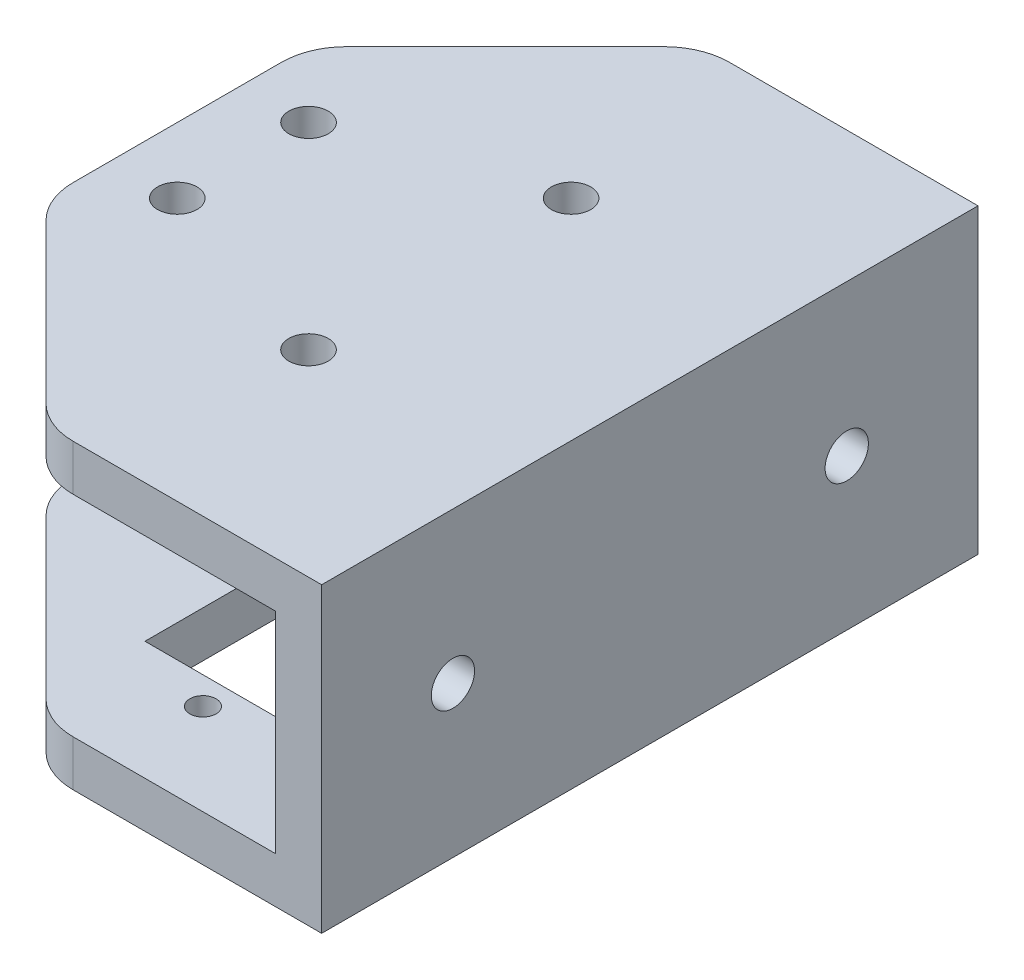
ISO-10303-21;
HEADER;
FILE_DESCRIPTION(('STEP AP214'),'2;1');
FILE_NAME('part.step','',(''),(''),'','','');
FILE_SCHEMA(('AUTOMOTIVE_DESIGN { 1 0 10303 214 1 1 1 1 }'));
ENDSEC;
DATA;
#1=APPLICATION_CONTEXT('core data for automotive mechanical design processes');
#2=APPLICATION_PROTOCOL_DEFINITION('international standard','automotive_design',2000,#1);
#3=PRODUCT_CONTEXT('',#1,'mechanical');
#4=PRODUCT('Part','Part','',(#3));
#5=PRODUCT_RELATED_PRODUCT_CATEGORY('part','',(#4));
#6=PRODUCT_DEFINITION_FORMATION('','',#4);
#7=PRODUCT_DEFINITION_CONTEXT('part definition',#1,'design');
#8=PRODUCT_DEFINITION('design','',#6,#7);
#9=PRODUCT_DEFINITION_SHAPE('','',#8);
#10=(LENGTH_UNIT() NAMED_UNIT(*) SI_UNIT(.MILLI.,.METRE.));
#11=(NAMED_UNIT(*) PLANE_ANGLE_UNIT() SI_UNIT($,.RADIAN.));
#12=(NAMED_UNIT(*) SI_UNIT($,.STERADIAN.) SOLID_ANGLE_UNIT());
#13=UNCERTAINTY_MEASURE_WITH_UNIT(LENGTH_MEASURE(1.E-05),#10,'distance_accuracy_value','');
#14=(GEOMETRIC_REPRESENTATION_CONTEXT(3) GLOBAL_UNCERTAINTY_ASSIGNED_CONTEXT((#13)) GLOBAL_UNIT_ASSIGNED_CONTEXT((#10,
#11,#12)) REPRESENTATION_CONTEXT('',''));
#15=CARTESIAN_POINT('',(0.,0.,0.));
#16=DIRECTION('',(0.,0.,1.));
#17=DIRECTION('',(1.,0.,0.));
#18=AXIS2_PLACEMENT_3D('',#15,#16,#17);
#19=CARTESIAN_POINT('',(-45.,8.,50.));
#20=DIRECTION('',(0.,1.,0.));
#21=DIRECTION('',(0.,0.,1.));
#22=AXIS2_PLACEMENT_3D('',#19,#20,#21);
#23=PLANE('',#22);
#24=CARTESIAN_POINT('',(-16.,8.,15.));
#25=DIRECTION('',(0.,1.,0.));
#26=DIRECTION('',(0.,0.,1.));
#27=AXIS2_PLACEMENT_3D('',#24,#25,#26);
#28=CIRCLE('',#27,1.5);
#29=CARTESIAN_POINT('',(-16.,8.,16.5));
#30=VERTEX_POINT('',#29);
#31=EDGE_CURVE('E300',#30,#30,#28,.T.);
#32=ORIENTED_EDGE('',*,*,#31,.T.);
#33=EDGE_LOOP('',(#32));
#34=FACE_BOUND('',#33,.T.);
#35=CARTESIAN_POINT('',(-31.,8.,30.));
#36=DIRECTION('',(0.,1.,0.));
#37=DIRECTION('',(0.,0.,1.));
#38=AXIS2_PLACEMENT_3D('',#35,#36,#37);
#39=CIRCLE('',#38,1.5);
#40=CARTESIAN_POINT('',(-31.,8.,31.5));
#41=VERTEX_POINT('',#40);
#42=EDGE_CURVE('E303',#41,#41,#39,.T.);
#43=ORIENTED_EDGE('',*,*,#42,.T.);
#44=EDGE_LOOP('',(#43));
#45=FACE_BOUND('',#44,.T.);
#46=CARTESIAN_POINT('',(-31.,8.,20.));
#47=DIRECTION('',(0.,1.,0.));
#48=DIRECTION('',(0.,0.,1.));
#49=AXIS2_PLACEMENT_3D('',#46,#47,#48);
#50=CIRCLE('',#49,1.5);
#51=CARTESIAN_POINT('',(-31.,8.,21.5));
#52=VERTEX_POINT('',#51);
#53=EDGE_CURVE('E295',#52,#52,#50,.T.);
#54=ORIENTED_EDGE('',*,*,#53,.T.);
#55=EDGE_LOOP('',(#54));
#56=FACE_BOUND('',#55,.T.);
#57=CARTESIAN_POINT('',(-16.,8.,35.));
#58=DIRECTION('',(0.,1.,0.));
#59=DIRECTION('',(0.,0.,1.));
#60=AXIS2_PLACEMENT_3D('',#57,#58,#59);
#61=CIRCLE('',#60,1.5);
#62=CARTESIAN_POINT('',(-16.,8.,36.5));
#63=VERTEX_POINT('',#62);
#64=EDGE_CURVE('E296',#63,#63,#61,.T.);
#65=ORIENTED_EDGE('',*,*,#64,.T.);
#66=EDGE_LOOP('',(#65));
#67=FACE_BOUND('',#66,.T.);
#68=DIRECTION('',(0.707106781186548,0.,0.707106781186548));
#69=VECTOR('',#68,1.);
#70=CARTESIAN_POINT('',(-33.,8.,38.));
#71=LINE('',#70,#69);
#72=CARTESIAN_POINT('',(-34.5355339059327,8.,36.4644660940672));
#73=VERTEX_POINT('',#72);
#74=CARTESIAN_POINT('',(-22.4644660940672,8.,48.5355339059327));
#75=VERTEX_POINT('',#74);
#76=EDGE_CURVE('E286',#73,#75,#71,.T.);
#77=ORIENTED_EDGE('',*,*,#76,.F.);
#78=CARTESIAN_POINT('',(-31.,8.,32.9289321881345));
#79=DIRECTION('',(0.,1.,0.));
#80=DIRECTION('',(0.,0.,1.));
#81=AXIS2_PLACEMENT_3D('',#78,#79,#80);
#82=CIRCLE('',#81,5.);
#83=CARTESIAN_POINT('',(-36.,8.,32.9289321881345));
#84=VERTEX_POINT('',#83);
#85=EDGE_CURVE('E404',#73,#84,#82,.F.);
#86=ORIENTED_EDGE('',*,*,#85,.T.);
#87=DIRECTION('',(0.,0.,1.));
#88=VECTOR('',#87,1.);
#89=CARTESIAN_POINT('',(-36.,8.,50.));
#90=LINE('',#89,#88);
#91=CARTESIAN_POINT('',(-36.,8.,17.0710678118655));
#92=VERTEX_POINT('',#91);
#93=EDGE_CURVE('E292',#92,#84,#90,.T.);
#94=ORIENTED_EDGE('',*,*,#93,.F.);
#95=CARTESIAN_POINT('',(-31.,8.,17.0710678118655));
#96=DIRECTION('',(0.,1.,0.));
#97=DIRECTION('',(0.,0.,1.));
#98=AXIS2_PLACEMENT_3D('',#95,#96,#97);
#99=CIRCLE('',#98,5.);
#100=CARTESIAN_POINT('',(-34.5355339059327,8.,13.5355339059327));
#101=VERTEX_POINT('',#100);
#102=EDGE_CURVE('E402',#92,#101,#99,.F.);
#103=ORIENTED_EDGE('',*,*,#102,.T.);
#104=DIRECTION('',(-0.707106781186548,0.,0.707106781186548));
#105=VECTOR('',#104,1.);
#106=CARTESIAN_POINT('',(-58.,8.,37.));
#107=LINE('',#106,#105);
#108=CARTESIAN_POINT('',(-22.4644660940672,8.,1.46446609406726));
#109=VERTEX_POINT('',#108);
#110=EDGE_CURVE('E277',#109,#101,#107,.T.);
#111=ORIENTED_EDGE('',*,*,#110,.F.);
#112=CARTESIAN_POINT('',(-18.9289321881345,8.,5.));
#113=DIRECTION('',(0.,1.,0.));
#114=DIRECTION('',(0.,0.,1.));
#115=AXIS2_PLACEMENT_3D('',#112,#113,#114);
#116=CIRCLE('',#115,5.);
#117=CARTESIAN_POINT('',(-18.9289321881345,8.,0.));
#118=VERTEX_POINT('',#117);
#119=EDGE_CURVE('E400',#109,#118,#116,.F.);
#120=ORIENTED_EDGE('',*,*,#119,.T.);
#121=DIRECTION('',(1.,0.,0.));
#122=VECTOR('',#121,1.);
#123=CARTESIAN_POINT('',(-45.,8.,0.));
#124=LINE('',#123,#122);
#125=CARTESIAN_POINT('',(-3.5,8.,0.));
#126=VERTEX_POINT('',#125);
#127=EDGE_CURVE('E324',#118,#126,#124,.T.);
#128=ORIENTED_EDGE('',*,*,#127,.T.);
#129=DIRECTION('',(0.,0.,-1.));
#130=VECTOR('',#129,1.);
#131=CARTESIAN_POINT('',(-3.5,8.,50.));
#132=LINE('',#131,#130);
#133=CARTESIAN_POINT('',(-3.5,8.,50.));
#134=VERTEX_POINT('',#133);
#135=EDGE_CURVE('E346',#134,#126,#132,.T.);
#136=ORIENTED_EDGE('',*,*,#135,.F.);
#137=DIRECTION('',(1.,0.,0.));
#138=VECTOR('',#137,1.);
#139=CARTESIAN_POINT('',(-45.,8.,50.));
#140=LINE('',#139,#138);
#141=CARTESIAN_POINT('',(-18.9289321881345,8.,50.));
#142=VERTEX_POINT('',#141);
#143=EDGE_CURVE('E308',#142,#134,#140,.T.);
#144=ORIENTED_EDGE('',*,*,#143,.F.);
#145=CARTESIAN_POINT('',(-18.9289321881345,8.,45.));
#146=DIRECTION('',(0.,1.,0.));
#147=DIRECTION('',(0.,0.,1.));
#148=AXIS2_PLACEMENT_3D('',#145,#146,#147);
#149=CIRCLE('',#148,5.);
#150=EDGE_CURVE('E398',#142,#75,#149,.F.);
#151=ORIENTED_EDGE('',*,*,#150,.T.);
#152=EDGE_LOOP('',(#77,#86,#94,#103,#111,#120,#128,#136,#144,#151));
#153=FACE_BOUND('',#152,.T.);
#154=ADVANCED_FACE('F40',(#34,#45,#56,#67,#153),#23,.F.);
#155=CARTESIAN_POINT('',(-3.5,-8.,50.));
#156=DIRECTION('',(0.,-1.,0.));
#157=DIRECTION('',(1.,0.,0.));
#158=AXIS2_PLACEMENT_3D('',#155,#156,#157);
#159=PLANE('',#158);
#160=DIRECTION('',(-1.,0.,0.));
#161=VECTOR('',#160,1.);
#162=CARTESIAN_POINT('',(-3.5,-8.,40.96));
#163=LINE('',#162,#161);
#164=CARTESIAN_POINT('',(-9.5,-8.,40.96));
#165=VERTEX_POINT('',#164);
#166=CARTESIAN_POINT('',(-22.5,-8.,40.96));
#167=VERTEX_POINT('',#166);
#168=EDGE_CURVE('E232',#165,#167,#163,.T.);
#169=ORIENTED_EDGE('',*,*,#168,.T.);
#170=DIRECTION('',(0.,0.,-1.));
#171=VECTOR('',#170,1.);
#172=CARTESIAN_POINT('',(-22.5,-8.,50.));
#173=LINE('',#172,#171);
#174=CARTESIAN_POINT('',(-22.5,-8.,17.46));
#175=VERTEX_POINT('',#174);
#176=EDGE_CURVE('E235',#167,#175,#173,.T.);
#177=ORIENTED_EDGE('',*,*,#176,.T.);
#178=DIRECTION('',(1.,0.,0.));
#179=VECTOR('',#178,1.);
#180=CARTESIAN_POINT('',(-3.49999999999999,-8.,17.46));
#181=LINE('',#180,#179);
#182=CARTESIAN_POINT('',(-9.5,-8.,17.46));
#183=VERTEX_POINT('',#182);
#184=EDGE_CURVE('E227',#175,#183,#181,.T.);
#185=ORIENTED_EDGE('',*,*,#184,.T.);
#186=DIRECTION('',(0.,0.,1.));
#187=VECTOR('',#186,1.);
#188=CARTESIAN_POINT('',(-9.5,-8.,50.));
#189=LINE('',#188,#187);
#190=EDGE_CURVE('E207',#183,#165,#189,.T.);
#191=ORIENTED_EDGE('',*,*,#190,.T.);
#192=EDGE_LOOP('',(#169,#177,#185,#191));
#193=FACE_BOUND('',#192,.T.);
#194=CARTESIAN_POINT('',(-16.,-8.,43.045));
#195=DIRECTION('',(0.,-1.,0.));
#196=DIRECTION('',(1.,0.,0.));
#197=AXIS2_PLACEMENT_3D('',#194,#195,#196);
#198=CIRCLE('',#197,1.);
#199=CARTESIAN_POINT('',(-15.,-8.,43.045));
#200=VERTEX_POINT('',#199);
#201=EDGE_CURVE('E247',#200,#200,#198,.T.);
#202=ORIENTED_EDGE('',*,*,#201,.T.);
#203=EDGE_LOOP('',(#202));
#204=FACE_BOUND('',#203,.T.);
#205=CARTESIAN_POINT('',(-16.,-8.,15.375));
#206=DIRECTION('',(0.,-1.,0.));
#207=DIRECTION('',(1.,0.,0.));
#208=AXIS2_PLACEMENT_3D('',#205,#206,#207);
#209=CIRCLE('',#208,1.);
#210=CARTESIAN_POINT('',(-15.,-8.,15.375));
#211=VERTEX_POINT('',#210);
#212=EDGE_CURVE('E242',#211,#211,#209,.T.);
#213=ORIENTED_EDGE('',*,*,#212,.T.);
#214=EDGE_LOOP('',(#213));
#215=FACE_BOUND('',#214,.T.);
#216=CARTESIAN_POINT('',(-31.,-8.,30.));
#217=DIRECTION('',(0.,-1.,0.));
#218=DIRECTION('',(1.,0.,0.));
#219=AXIS2_PLACEMENT_3D('',#216,#217,#218);
#220=CIRCLE('',#219,1.5);
#221=CARTESIAN_POINT('',(-29.5,-8.,30.));
#222=VERTEX_POINT('',#221);
#223=EDGE_CURVE('E259',#222,#222,#220,.T.);
#224=ORIENTED_EDGE('',*,*,#223,.T.);
#225=EDGE_LOOP('',(#224));
#226=FACE_BOUND('',#225,.T.);
#227=CARTESIAN_POINT('',(-31.,-8.,20.));
#228=DIRECTION('',(0.,-1.,0.));
#229=DIRECTION('',(1.,0.,0.));
#230=AXIS2_PLACEMENT_3D('',#227,#228,#229);
#231=CIRCLE('',#230,1.5);
#232=CARTESIAN_POINT('',(-29.5,-8.,20.));
#233=VERTEX_POINT('',#232);
#234=EDGE_CURVE('E254',#233,#233,#231,.T.);
#235=ORIENTED_EDGE('',*,*,#234,.T.);
#236=EDGE_LOOP('',(#235));
#237=FACE_BOUND('',#236,.T.);
#238=DIRECTION('',(0.707106781186548,0.,-0.707106781186548));
#239=VECTOR('',#238,1.);
#240=CARTESIAN_POINT('',(-37.25,-8.,16.25));
#241=LINE('',#240,#239);
#242=CARTESIAN_POINT('',(-34.5355339059327,-8.,13.5355339059327));
#243=VERTEX_POINT('',#242);
#244=CARTESIAN_POINT('',(-22.4644660940673,-8.,1.46446609406726));
#245=VERTEX_POINT('',#244);
#246=EDGE_CURVE('E274',#243,#245,#241,.T.);
#247=ORIENTED_EDGE('',*,*,#246,.F.);
#248=CARTESIAN_POINT('',(-31.,-7.99999999999999,17.0710678118655));
#249=DIRECTION('',(0.,-1.,0.));
#250=DIRECTION('',(1.,0.,0.));
#251=AXIS2_PLACEMENT_3D('',#248,#249,#250);
#252=CIRCLE('',#251,5.);
#253=CARTESIAN_POINT('',(-36.,-8.,17.0710678118655));
#254=VERTEX_POINT('',#253);
#255=EDGE_CURVE('E386',#243,#254,#252,.F.);
#256=ORIENTED_EDGE('',*,*,#255,.T.);
#257=DIRECTION('',(0.,0.,-1.));
#258=VECTOR('',#257,1.);
#259=CARTESIAN_POINT('',(-36.,-8.,50.));
#260=LINE('',#259,#258);
#261=CARTESIAN_POINT('',(-36.,-8.,32.9289321881345));
#262=VERTEX_POINT('',#261);
#263=EDGE_CURVE('E289',#262,#254,#260,.T.);
#264=ORIENTED_EDGE('',*,*,#263,.F.);
#265=CARTESIAN_POINT('',(-31.,-7.99999999999999,32.9289321881345));
#266=DIRECTION('',(0.,-1.,0.));
#267=DIRECTION('',(1.,0.,0.));
#268=AXIS2_PLACEMENT_3D('',#265,#266,#267);
#269=CIRCLE('',#268,5.);
#270=CARTESIAN_POINT('',(-34.5355339059327,-8.00000000000001,36.4644660940673));
#271=VERTEX_POINT('',#270);
#272=EDGE_CURVE('E384',#262,#271,#269,.F.);
#273=ORIENTED_EDGE('',*,*,#272,.T.);
#274=DIRECTION('',(-0.707106781186548,0.,-0.707106781186548));
#275=VECTOR('',#274,1.);
#276=CARTESIAN_POINT('',(-12.25,-8.,58.75));
#277=LINE('',#276,#275);
#278=CARTESIAN_POINT('',(-22.4644660940672,-8.,48.5355339059327));
#279=VERTEX_POINT('',#278);
#280=EDGE_CURVE('E283',#279,#271,#277,.T.);
#281=ORIENTED_EDGE('',*,*,#280,.F.);
#282=CARTESIAN_POINT('',(-18.9289321881345,-8.,45.));
#283=DIRECTION('',(0.,-1.,0.));
#284=DIRECTION('',(1.,0.,0.));
#285=AXIS2_PLACEMENT_3D('',#282,#283,#284);
#286=CIRCLE('',#285,5.);
#287=CARTESIAN_POINT('',(-18.9289321881345,-8.,50.));
#288=VERTEX_POINT('',#287);
#289=EDGE_CURVE('E380',#279,#288,#286,.F.);
#290=ORIENTED_EDGE('',*,*,#289,.T.);
#291=DIRECTION('',(-1.,0.,0.));
#292=VECTOR('',#291,1.);
#293=CARTESIAN_POINT('',(-3.5,-8.,50.));
#294=LINE('',#293,#292);
#295=CARTESIAN_POINT('',(-3.5,-8.,50.));
#296=VERTEX_POINT('',#295);
#297=EDGE_CURVE('E313',#296,#288,#294,.T.);
#298=ORIENTED_EDGE('',*,*,#297,.F.);
#299=DIRECTION('',(0.,0.,-1.));
#300=VECTOR('',#299,1.);
#301=CARTESIAN_POINT('',(-3.5,-8.,50.));
#302=LINE('',#301,#300);
#303=CARTESIAN_POINT('',(-3.5,-8.,0.));
#304=VERTEX_POINT('',#303);
#305=EDGE_CURVE('E343',#296,#304,#302,.T.);
#306=ORIENTED_EDGE('',*,*,#305,.T.);
#307=DIRECTION('',(-1.,0.,0.));
#308=VECTOR('',#307,1.);
#309=CARTESIAN_POINT('',(-3.5,-8.,0.));
#310=LINE('',#309,#308);
#311=CARTESIAN_POINT('',(-18.9289321881345,-8.,0.));
#312=VERTEX_POINT('',#311);
#313=EDGE_CURVE('E329',#304,#312,#310,.T.);
#314=ORIENTED_EDGE('',*,*,#313,.T.);
#315=CARTESIAN_POINT('',(-18.9289321881345,-7.99999999999999,5.));
#316=DIRECTION('',(0.,-1.,0.));
#317=DIRECTION('',(1.,0.,0.));
#318=AXIS2_PLACEMENT_3D('',#315,#316,#317);
#319=CIRCLE('',#318,5.);
#320=EDGE_CURVE('E382',#312,#245,#319,.F.);
#321=ORIENTED_EDGE('',*,*,#320,.T.);
#322=EDGE_LOOP('',(#247,#256,#264,#273,#281,#290,#298,#306,#314,#321));
#323=FACE_BOUND('',#322,.T.);
#324=ADVANCED_FACE('F520',(#193,#204,#215,#226,#237,#323),#159,.F.);
#325=CARTESIAN_POINT('',(0.,-11.5,50.));
#326=DIRECTION('',(0.,1.,0.));
#327=DIRECTION('',(0.,0.,1.));
#328=AXIS2_PLACEMENT_3D('',#325,#326,#327);
#329=PLANE('',#328);
#330=DIRECTION('',(1.,0.,0.));
#331=VECTOR('',#330,1.);
#332=CARTESIAN_POINT('',(-9.5,-11.5,17.46));
#333=LINE('',#332,#331);
#334=CARTESIAN_POINT('',(-22.5,-11.5,17.46));
#335=VERTEX_POINT('',#334);
#336=CARTESIAN_POINT('',(-9.5,-11.5,17.46));
#337=VERTEX_POINT('',#336);
#338=EDGE_CURVE('E213',#335,#337,#333,.T.);
#339=ORIENTED_EDGE('',*,*,#338,.F.);
#340=DIRECTION('',(0.,0.,-1.));
#341=VECTOR('',#340,1.);
#342=CARTESIAN_POINT('',(-22.5,-11.5,17.46));
#343=LINE('',#342,#341);
#344=CARTESIAN_POINT('',(-22.5,-11.5,40.96));
#345=VERTEX_POINT('',#344);
#346=EDGE_CURVE('E63',#345,#335,#343,.T.);
#347=ORIENTED_EDGE('',*,*,#346,.F.);
#348=DIRECTION('',(-1.,0.,0.));
#349=VECTOR('',#348,1.);
#350=CARTESIAN_POINT('',(-9.5,-11.5,40.96));
#351=LINE('',#350,#349);
#352=CARTESIAN_POINT('',(-9.5,-11.5,40.96));
#353=VERTEX_POINT('',#352);
#354=EDGE_CURVE('E220',#353,#345,#351,.T.);
#355=ORIENTED_EDGE('',*,*,#354,.F.);
#356=DIRECTION('',(0.,0.,1.));
#357=VECTOR('',#356,1.);
#358=CARTESIAN_POINT('',(-9.5,-11.5,17.46));
#359=LINE('',#358,#357);
#360=EDGE_CURVE('E204',#337,#353,#359,.T.);
#361=ORIENTED_EDGE('',*,*,#360,.F.);
#362=EDGE_LOOP('',(#339,#347,#355,#361));
#363=FACE_BOUND('',#362,.T.);
#364=CARTESIAN_POINT('',(-16.,-11.5,43.045));
#365=DIRECTION('',(0.,-1.,0.));
#366=DIRECTION('',(0.,0.,-1.));
#367=AXIS2_PLACEMENT_3D('',#364,#365,#366);
#368=CIRCLE('',#367,1.);
#369=CARTESIAN_POINT('',(-16.,-11.5,42.045));
#370=VERTEX_POINT('',#369);
#371=EDGE_CURVE('E239',#370,#370,#368,.T.);
#372=ORIENTED_EDGE('',*,*,#371,.F.);
#373=EDGE_LOOP('',(#372));
#374=FACE_BOUND('',#373,.T.);
#375=CARTESIAN_POINT('',(-16.,-11.5,15.375));
#376=DIRECTION('',(0.,-1.,0.));
#377=DIRECTION('',(0.,0.,-1.));
#378=AXIS2_PLACEMENT_3D('',#375,#376,#377);
#379=CIRCLE('',#378,1.);
#380=CARTESIAN_POINT('',(-16.,-11.5,14.375));
#381=VERTEX_POINT('',#380);
#382=EDGE_CURVE('E238',#381,#381,#379,.T.);
#383=ORIENTED_EDGE('',*,*,#382,.F.);
#384=EDGE_LOOP('',(#383));
#385=FACE_BOUND('',#384,.T.);
#386=CARTESIAN_POINT('',(-31.,-11.5,30.));
#387=DIRECTION('',(0.,-1.,0.));
#388=DIRECTION('',(0.,0.,-1.));
#389=AXIS2_PLACEMENT_3D('',#386,#387,#388);
#390=CIRCLE('',#389,1.5);
#391=CARTESIAN_POINT('',(-31.,-11.5,28.5));
#392=VERTEX_POINT('',#391);
#393=EDGE_CURVE('E251',#392,#392,#390,.T.);
#394=ORIENTED_EDGE('',*,*,#393,.F.);
#395=EDGE_LOOP('',(#394));
#396=FACE_BOUND('',#395,.T.);
#397=CARTESIAN_POINT('',(-31.,-11.5,20.));
#398=DIRECTION('',(0.,-1.,0.));
#399=DIRECTION('',(0.,0.,-1.));
#400=AXIS2_PLACEMENT_3D('',#397,#398,#399);
#401=CIRCLE('',#400,1.5);
#402=CARTESIAN_POINT('',(-31.,-11.5,18.5));
#403=VERTEX_POINT('',#402);
#404=EDGE_CURVE('E250',#403,#403,#401,.T.);
#405=ORIENTED_EDGE('',*,*,#404,.F.);
#406=EDGE_LOOP('',(#405));
#407=FACE_BOUND('',#406,.T.);
#408=DIRECTION('',(0.,0.,-1.));
#409=VECTOR('',#408,1.);
#410=CARTESIAN_POINT('',(-36.,-11.5,15.));
#411=LINE('',#410,#409);
#412=CARTESIAN_POINT('',(-36.,-11.5,32.9289321881345));
#413=VERTEX_POINT('',#412);
#414=CARTESIAN_POINT('',(-36.,-11.5,17.0710678118655));
#415=VERTEX_POINT('',#414);
#416=EDGE_CURVE('E265',#413,#415,#411,.T.);
#417=ORIENTED_EDGE('',*,*,#416,.T.);
#418=CARTESIAN_POINT('',(-31.,-11.5,17.0710678118655));
#419=DIRECTION('',(0.,1.,0.));
#420=DIRECTION('',(0.,0.,1.));
#421=AXIS2_PLACEMENT_3D('',#418,#419,#420);
#422=CIRCLE('',#421,5.);
#423=CARTESIAN_POINT('',(-34.5355339059327,-11.5,13.5355339059327));
#424=VERTEX_POINT('',#423);
#425=EDGE_CURVE('E373',#415,#424,#422,.F.);
#426=ORIENTED_EDGE('',*,*,#425,.T.);
#427=DIRECTION('',(0.707106781186547,0.,-0.707106781186547));
#428=VECTOR('',#427,1.);
#429=CARTESIAN_POINT('',(-21.,-11.5,0.));
#430=LINE('',#429,#428);
#431=CARTESIAN_POINT('',(-22.4644660940673,-11.5,1.46446609406726));
#432=VERTEX_POINT('',#431);
#433=EDGE_CURVE('E268',#424,#432,#430,.T.);
#434=ORIENTED_EDGE('',*,*,#433,.T.);
#435=CARTESIAN_POINT('',(-18.9289321881345,-11.5,5.));
#436=DIRECTION('',(0.,1.,0.));
#437=DIRECTION('',(0.,0.,1.));
#438=AXIS2_PLACEMENT_3D('',#435,#436,#437);
#439=CIRCLE('',#438,5.);
#440=CARTESIAN_POINT('',(-18.9289321881345,-11.5,0.));
#441=VERTEX_POINT('',#440);
#442=EDGE_CURVE('E369',#432,#441,#439,.F.);
#443=ORIENTED_EDGE('',*,*,#442,.T.);
#444=DIRECTION('',(1.,0.,0.));
#445=VECTOR('',#444,1.);
#446=CARTESIAN_POINT('',(0.,-11.5,0.));
#447=LINE('',#446,#445);
#448=CARTESIAN_POINT('',(0.,-11.5,0.));
#449=VERTEX_POINT('',#448);
#450=EDGE_CURVE('E332',#441,#449,#447,.T.);
#451=ORIENTED_EDGE('',*,*,#450,.T.);
#452=DIRECTION('',(0.,0.,-1.));
#453=VECTOR('',#452,1.);
#454=CARTESIAN_POINT('',(0.,-11.5,50.));
#455=LINE('',#454,#453);
#456=CARTESIAN_POINT('',(0.,-11.5,50.));
#457=VERTEX_POINT('',#456);
#458=EDGE_CURVE('E340',#457,#449,#455,.T.);
#459=ORIENTED_EDGE('',*,*,#458,.F.);
#460=DIRECTION('',(1.,0.,0.));
#461=VECTOR('',#460,1.);
#462=CARTESIAN_POINT('',(0.,-11.5,50.));
#463=LINE('',#462,#461);
#464=CARTESIAN_POINT('',(-18.9289321881345,-11.5,50.));
#465=VERTEX_POINT('',#464);
#466=EDGE_CURVE('E316',#465,#457,#463,.T.);
#467=ORIENTED_EDGE('',*,*,#466,.F.);
#468=CARTESIAN_POINT('',(-18.9289321881345,-11.5,45.));
#469=DIRECTION('',(0.,1.,0.));
#470=DIRECTION('',(0.,0.,1.));
#471=AXIS2_PLACEMENT_3D('',#468,#469,#470);
#472=CIRCLE('',#471,5.);
#473=CARTESIAN_POINT('',(-22.4644660940672,-11.5,48.5355339059327));
#474=VERTEX_POINT('',#473);
#475=EDGE_CURVE('E367',#465,#474,#472,.F.);
#476=ORIENTED_EDGE('',*,*,#475,.T.);
#477=DIRECTION('',(-0.707106781186547,0.,-0.707106781186547));
#478=VECTOR('',#477,1.);
#479=CARTESIAN_POINT('',(-36.,-11.5,35.));
#480=LINE('',#479,#478);
#481=CARTESIAN_POINT('',(-34.5355339059327,-11.5,36.4644660940673));
#482=VERTEX_POINT('',#481);
#483=EDGE_CURVE('E262',#474,#482,#480,.T.);
#484=ORIENTED_EDGE('',*,*,#483,.T.);
#485=CARTESIAN_POINT('',(-31.,-11.5,32.9289321881345));
#486=DIRECTION('',(0.,1.,0.));
#487=DIRECTION('',(0.,0.,1.));
#488=AXIS2_PLACEMENT_3D('',#485,#486,#487);
#489=CIRCLE('',#488,5.);
#490=EDGE_CURVE('E371',#482,#413,#489,.F.);
#491=ORIENTED_EDGE('',*,*,#490,.T.);
#492=EDGE_LOOP('',(#417,#426,#434,#443,#451,#459,#467,#476,#484,#491));
#493=FACE_BOUND('',#492,.T.);
#494=ADVANCED_FACE('F217',(#363,#374,#385,#396,#407,#493),#329,.F.);
#495=CARTESIAN_POINT('',(-45.,11.5,50.));
#496=DIRECTION('',(0.,-1.,0.));
#497=DIRECTION('',(0.,0.,-1.));
#498=AXIS2_PLACEMENT_3D('',#495,#496,#497);
#499=PLANE('',#498);
#500=CARTESIAN_POINT('',(-16.,11.5,15.));
#501=DIRECTION('',(0.,-1.,0.));
#502=DIRECTION('',(0.,0.,-1.));
#503=AXIS2_PLACEMENT_3D('',#500,#501,#502);
#504=CIRCLE('',#503,1.5);
#505=CARTESIAN_POINT('',(-16.,11.5,13.5));
#506=VERTEX_POINT('',#505);
#507=EDGE_CURVE('E299',#506,#506,#504,.F.);
#508=ORIENTED_EDGE('',*,*,#507,.F.);
#509=EDGE_LOOP('',(#508));
#510=FACE_BOUND('',#509,.T.);
#511=CARTESIAN_POINT('',(-31.,11.5,30.));
#512=DIRECTION('',(0.,-1.,0.));
#513=DIRECTION('',(0.,0.,-1.));
#514=AXIS2_PLACEMENT_3D('',#511,#512,#513);
#515=CIRCLE('',#514,1.5);
#516=CARTESIAN_POINT('',(-31.,11.5,28.5));
#517=VERTEX_POINT('',#516);
#518=EDGE_CURVE('E352',#517,#517,#515,.F.);
#519=ORIENTED_EDGE('',*,*,#518,.F.);
#520=EDGE_LOOP('',(#519));
#521=FACE_BOUND('',#520,.T.);
#522=CARTESIAN_POINT('',(-31.,11.5,20.));
#523=DIRECTION('',(0.,-1.,0.));
#524=DIRECTION('',(0.,0.,-1.));
#525=AXIS2_PLACEMENT_3D('',#522,#523,#524);
#526=CIRCLE('',#525,1.5);
#527=CARTESIAN_POINT('',(-31.,11.5,18.5));
#528=VERTEX_POINT('',#527);
#529=EDGE_CURVE('E355',#528,#528,#526,.F.);
#530=ORIENTED_EDGE('',*,*,#529,.F.);
#531=EDGE_LOOP('',(#530));
#532=FACE_BOUND('',#531,.T.);
#533=CARTESIAN_POINT('',(-16.,11.5,35.));
#534=DIRECTION('',(0.,-1.,0.));
#535=DIRECTION('',(0.,0.,-1.));
#536=AXIS2_PLACEMENT_3D('',#533,#534,#535);
#537=CIRCLE('',#536,1.5);
#538=CARTESIAN_POINT('',(-16.,11.5,33.5));
#539=VERTEX_POINT('',#538);
#540=EDGE_CURVE('E327',#539,#539,#537,.F.);
#541=ORIENTED_EDGE('',*,*,#540,.F.);
#542=EDGE_LOOP('',(#541));
#543=FACE_BOUND('',#542,.T.);
#544=DIRECTION('',(0.,0.,-1.));
#545=VECTOR('',#544,1.);
#546=CARTESIAN_POINT('',(-36.,11.5,50.));
#547=LINE('',#546,#545);
#548=CARTESIAN_POINT('',(-36.,11.5,32.9289321881345));
#549=VERTEX_POINT('',#548);
#550=CARTESIAN_POINT('',(-36.,11.5,17.0710678118655));
#551=VERTEX_POINT('',#550);
#552=EDGE_CURVE('E349',#549,#551,#547,.T.);
#553=ORIENTED_EDGE('',*,*,#552,.F.);
#554=CARTESIAN_POINT('',(-31.,11.5,32.9289321881345));
#555=DIRECTION('',(0.,-1.,0.));
#556=DIRECTION('',(0.,0.,-1.));
#557=AXIS2_PLACEMENT_3D('',#554,#555,#556);
#558=CIRCLE('',#557,5.);
#559=CARTESIAN_POINT('',(-34.5355339059327,11.5,36.4644660940672));
#560=VERTEX_POINT('',#559);
#561=EDGE_CURVE('E417',#549,#560,#558,.F.);
#562=ORIENTED_EDGE('',*,*,#561,.T.);
#563=DIRECTION('',(-0.707106781186548,0.,-0.707106781186548));
#564=VECTOR('',#563,1.);
#565=CARTESIAN_POINT('',(-33.,11.5,38.));
#566=LINE('',#565,#564);
#567=CARTESIAN_POINT('',(-22.4644660940672,11.5,48.5355339059327));
#568=VERTEX_POINT('',#567);
#569=EDGE_CURVE('E280',#568,#560,#566,.T.);
#570=ORIENTED_EDGE('',*,*,#569,.F.);
#571=CARTESIAN_POINT('',(-18.9289321881345,11.5,45.));
#572=DIRECTION('',(0.,-1.,0.));
#573=DIRECTION('',(0.,0.,-1.));
#574=AXIS2_PLACEMENT_3D('',#571,#572,#573);
#575=CIRCLE('',#574,5.);
#576=CARTESIAN_POINT('',(-18.9289321881345,11.5,50.));
#577=VERTEX_POINT('',#576);
#578=EDGE_CURVE('E411',#568,#577,#575,.F.);
#579=ORIENTED_EDGE('',*,*,#578,.T.);
#580=DIRECTION('',(-1.,0.,0.));
#581=VECTOR('',#580,1.);
#582=CARTESIAN_POINT('',(-45.,11.5,50.));
#583=LINE('',#582,#581);
#584=CARTESIAN_POINT('',(0.,11.5,50.));
#585=VERTEX_POINT('',#584);
#586=EDGE_CURVE('E320',#585,#577,#583,.T.);
#587=ORIENTED_EDGE('',*,*,#586,.F.);
#588=DIRECTION('',(0.,0.,-1.));
#589=VECTOR('',#588,1.);
#590=CARTESIAN_POINT('',(0.,11.5,50.));
#591=LINE('',#590,#589);
#592=CARTESIAN_POINT('',(0.,11.5,0.));
#593=VERTEX_POINT('',#592);
#594=EDGE_CURVE('E323',#585,#593,#591,.T.);
#595=ORIENTED_EDGE('',*,*,#594,.T.);
#596=DIRECTION('',(-1.,0.,0.));
#597=VECTOR('',#596,1.);
#598=CARTESIAN_POINT('',(-45.,11.5,0.));
#599=LINE('',#598,#597);
#600=CARTESIAN_POINT('',(-18.9289321881345,11.5,0.));
#601=VERTEX_POINT('',#600);
#602=EDGE_CURVE('E311',#593,#601,#599,.T.);
#603=ORIENTED_EDGE('',*,*,#602,.T.);
#604=CARTESIAN_POINT('',(-18.9289321881345,11.5,5.));
#605=DIRECTION('',(0.,-1.,0.));
#606=DIRECTION('',(0.,0.,-1.));
#607=AXIS2_PLACEMENT_3D('',#604,#605,#606);
#608=CIRCLE('',#607,5.);
#609=CARTESIAN_POINT('',(-22.4644660940672,11.5,1.46446609406726));
#610=VERTEX_POINT('',#609);
#611=EDGE_CURVE('E413',#601,#610,#608,.F.);
#612=ORIENTED_EDGE('',*,*,#611,.T.);
#613=DIRECTION('',(0.707106781186548,0.,-0.707106781186548));
#614=VECTOR('',#613,1.);
#615=CARTESIAN_POINT('',(-58.,11.5,37.));
#616=LINE('',#615,#614);
#617=CARTESIAN_POINT('',(-34.5355339059327,11.5,13.5355339059327));
#618=VERTEX_POINT('',#617);
#619=EDGE_CURVE('E271',#618,#610,#616,.T.);
#620=ORIENTED_EDGE('',*,*,#619,.F.);
#621=CARTESIAN_POINT('',(-31.,11.5,17.0710678118655));
#622=DIRECTION('',(0.,-1.,0.));
#623=DIRECTION('',(0.,0.,-1.));
#624=AXIS2_PLACEMENT_3D('',#621,#622,#623);
#625=CIRCLE('',#624,5.);
#626=EDGE_CURVE('E415',#618,#551,#625,.F.);
#627=ORIENTED_EDGE('',*,*,#626,.T.);
#628=EDGE_LOOP('',(#553,#562,#570,#579,#587,#595,#603,#612,#620,#627));
#629=FACE_BOUND('',#628,.T.);
#630=ADVANCED_FACE('F493',(#510,#521,#532,#543,#629),#499,.F.);
#631=CARTESIAN_POINT('',(0.,0.,50.));
#632=DIRECTION('',(0.,0.,1.));
#633=DIRECTION('',(1.,0.,0.));
#634=AXIS2_PLACEMENT_3D('',#631,#632,#633);
#635=PLANE('',#634);
#636=ORIENTED_EDGE('',*,*,#297,.T.);
#637=DIRECTION('',(0.,-1.,0.));
#638=VECTOR('',#637,1.);
#639=CARTESIAN_POINT('',(-18.9289321881345,0.,50.));
#640=LINE('',#639,#638);
#641=EDGE_CURVE('E12',#288,#465,#640,.T.);
#642=ORIENTED_EDGE('',*,*,#641,.T.);
#643=ORIENTED_EDGE('',*,*,#466,.T.);
#644=DIRECTION('',(0.,1.,0.));
#645=VECTOR('',#644,1.);
#646=CARTESIAN_POINT('',(0.,11.5,50.));
#647=LINE('',#646,#645);
#648=EDGE_CURVE('E318',#457,#585,#647,.T.);
#649=ORIENTED_EDGE('',*,*,#648,.T.);
#650=ORIENTED_EDGE('',*,*,#586,.T.);
#651=DIRECTION('',(0.,-1.,0.));
#652=VECTOR('',#651,1.);
#653=CARTESIAN_POINT('',(-18.9289321881345,0.,50.));
#654=LINE('',#653,#652);
#655=EDGE_CURVE('E48',#577,#142,#654,.T.);
#656=ORIENTED_EDGE('',*,*,#655,.T.);
#657=ORIENTED_EDGE('',*,*,#143,.T.);
#658=DIRECTION('',(0.,-1.,0.));
#659=VECTOR('',#658,1.);
#660=CARTESIAN_POINT('',(-3.5,8.,50.));
#661=LINE('',#660,#659);
#662=EDGE_CURVE('E310',#134,#296,#661,.T.);
#663=ORIENTED_EDGE('',*,*,#662,.T.);
#664=EDGE_LOOP('',(#636,#642,#643,#649,#650,#656,#657,#663));
#665=FACE_BOUND('',#664,.T.);
#666=ADVANCED_FACE('F431',(#665),#635,.T.);
#667=CARTESIAN_POINT('',(0.,0.,0.));
#668=DIRECTION('',(0.,0.,1.));
#669=DIRECTION('',(1.,0.,0.));
#670=AXIS2_PLACEMENT_3D('',#667,#668,#669);
#671=PLANE('',#670);
#672=ORIENTED_EDGE('',*,*,#450,.F.);
#673=DIRECTION('',(0.,-1.,0.));
#674=VECTOR('',#673,1.);
#675=CARTESIAN_POINT('',(-18.9289321881345,-8.00000000000001,0.));
#676=LINE('',#675,#674);
#677=EDGE_CURVE('E426',#441,#312,#676,.F.);
#678=ORIENTED_EDGE('',*,*,#677,.T.);
#679=ORIENTED_EDGE('',*,*,#313,.F.);
#680=DIRECTION('',(0.,-1.,0.));
#681=VECTOR('',#680,1.);
#682=CARTESIAN_POINT('',(-3.5,8.,0.));
#683=LINE('',#682,#681);
#684=EDGE_CURVE('E326',#126,#304,#683,.T.);
#685=ORIENTED_EDGE('',*,*,#684,.F.);
#686=ORIENTED_EDGE('',*,*,#127,.F.);
#687=DIRECTION('',(0.,-1.,0.));
#688=VECTOR('',#687,1.);
#689=CARTESIAN_POINT('',(-18.9289321881345,11.5,0.));
#690=LINE('',#689,#688);
#691=EDGE_CURVE('E424',#118,#601,#690,.F.);
#692=ORIENTED_EDGE('',*,*,#691,.T.);
#693=ORIENTED_EDGE('',*,*,#602,.F.);
#694=DIRECTION('',(0.,1.,0.));
#695=VECTOR('',#694,1.);
#696=CARTESIAN_POINT('',(0.,11.5,0.));
#697=LINE('',#696,#695);
#698=EDGE_CURVE('E334',#449,#593,#697,.T.);
#699=ORIENTED_EDGE('',*,*,#698,.F.);
#700=EDGE_LOOP('',(#672,#678,#679,#685,#686,#692,#693,#699));
#701=FACE_BOUND('',#700,.T.);
#702=ADVANCED_FACE('F484',(#701),#671,.F.);
#703=CARTESIAN_POINT('',(-3.5,8.,50.));
#704=DIRECTION('',(1.,0.,0.));
#705=DIRECTION('',(0.,1.,0.));
#706=AXIS2_PLACEMENT_3D('',#703,#704,#705);
#707=PLANE('',#706);
#708=CARTESIAN_POINT('',(-3.5,0.,10.));
#709=DIRECTION('',(1.,0.,0.));
#710=DIRECTION('',(0.,1.,0.));
#711=AXIS2_PLACEMENT_3D('',#708,#709,#710);
#712=CIRCLE('',#711,1.65);
#713=CARTESIAN_POINT('',(-3.5,1.65,10.));
#714=VERTEX_POINT('',#713);
#715=EDGE_CURVE('E628',#714,#714,#712,.T.);
#716=ORIENTED_EDGE('',*,*,#715,.T.);
#717=EDGE_LOOP('',(#716));
#718=FACE_BOUND('',#717,.T.);
#719=CARTESIAN_POINT('',(-3.5,0.,40.));
#720=DIRECTION('',(1.,0.,0.));
#721=DIRECTION('',(0.,1.,0.));
#722=AXIS2_PLACEMENT_3D('',#719,#720,#721);
#723=CIRCLE('',#722,1.65);
#724=CARTESIAN_POINT('',(-3.5,1.65,40.));
#725=VERTEX_POINT('',#724);
#726=EDGE_CURVE('E623',#725,#725,#723,.T.);
#727=ORIENTED_EDGE('',*,*,#726,.T.);
#728=EDGE_LOOP('',(#727));
#729=FACE_BOUND('',#728,.T.);
#730=ORIENTED_EDGE('',*,*,#684,.T.);
#731=ORIENTED_EDGE('',*,*,#305,.F.);
#732=ORIENTED_EDGE('',*,*,#662,.F.);
#733=ORIENTED_EDGE('',*,*,#135,.T.);
#734=EDGE_LOOP('',(#730,#731,#732,#733));
#735=FACE_BOUND('',#734,.T.);
#736=ADVANCED_FACE('F443',(#718,#729,#735),#707,.F.);
#737=CARTESIAN_POINT('',(0.,11.5,50.));
#738=DIRECTION('',(-1.,0.,0.));
#739=DIRECTION('',(0.,0.,1.));
#740=AXIS2_PLACEMENT_3D('',#737,#738,#739);
#741=PLANE('',#740);
#742=CARTESIAN_POINT('',(0.,0.,10.));
#743=DIRECTION('',(1.,0.,0.));
#744=DIRECTION('',(0.,0.,-1.));
#745=AXIS2_PLACEMENT_3D('',#742,#743,#744);
#746=CIRCLE('',#745,1.65);
#747=CARTESIAN_POINT('',(0.,0.,8.35));
#748=VERTEX_POINT('',#747);
#749=EDGE_CURVE('E617',#748,#748,#746,.T.);
#750=ORIENTED_EDGE('',*,*,#749,.F.);
#751=EDGE_LOOP('',(#750));
#752=FACE_BOUND('',#751,.T.);
#753=CARTESIAN_POINT('',(0.,0.,40.));
#754=DIRECTION('',(1.,0.,0.));
#755=DIRECTION('',(0.,0.,-1.));
#756=AXIS2_PLACEMENT_3D('',#753,#754,#755);
#757=CIRCLE('',#756,1.65);
#758=CARTESIAN_POINT('',(0.,0.,38.35));
#759=VERTEX_POINT('',#758);
#760=EDGE_CURVE('E620',#759,#759,#757,.T.);
#761=ORIENTED_EDGE('',*,*,#760,.F.);
#762=EDGE_LOOP('',(#761));
#763=FACE_BOUND('',#762,.T.);
#764=ORIENTED_EDGE('',*,*,#698,.T.);
#765=ORIENTED_EDGE('',*,*,#594,.F.);
#766=ORIENTED_EDGE('',*,*,#648,.F.);
#767=ORIENTED_EDGE('',*,*,#458,.T.);
#768=EDGE_LOOP('',(#764,#765,#766,#767));
#769=FACE_BOUND('',#768,.T.);
#770=ADVANCED_FACE('F489',(#752,#763,#769),#741,.F.);
#771=CARTESIAN_POINT('',(-16.,78.,15.));
#772=DIRECTION('',(0.,-1.,0.));
#773=DIRECTION('',(0.,0.,-1.));
#774=AXIS2_PLACEMENT_3D('',#771,#772,#773);
#775=CYLINDRICAL_SURFACE('',#774,1.5);
#776=ORIENTED_EDGE('',*,*,#31,.F.);
#777=EDGE_LOOP('',(#776));
#778=FACE_BOUND('',#777,.T.);
#779=ORIENTED_EDGE('',*,*,#507,.T.);
#780=EDGE_LOOP('',(#779));
#781=FACE_BOUND('',#780,.T.);
#782=ADVANCED_FACE('F597',(#778,#781),#775,.F.);
#783=CARTESIAN_POINT('',(-31.,78.,30.));
#784=DIRECTION('',(0.,-1.,0.));
#785=DIRECTION('',(0.,0.,-1.));
#786=AXIS2_PLACEMENT_3D('',#783,#784,#785);
#787=CYLINDRICAL_SURFACE('',#786,1.5);
#788=ORIENTED_EDGE('',*,*,#42,.F.);
#789=EDGE_LOOP('',(#788));
#790=FACE_BOUND('',#789,.T.);
#791=ORIENTED_EDGE('',*,*,#518,.T.);
#792=EDGE_LOOP('',(#791));
#793=FACE_BOUND('',#792,.T.);
#794=ADVANCED_FACE('F595',(#790,#793),#787,.F.);
#795=CARTESIAN_POINT('',(-31.,78.,20.));
#796=DIRECTION('',(0.,-1.,0.));
#797=DIRECTION('',(0.,0.,-1.));
#798=AXIS2_PLACEMENT_3D('',#795,#796,#797);
#799=CYLINDRICAL_SURFACE('',#798,1.5);
#800=ORIENTED_EDGE('',*,*,#53,.F.);
#801=EDGE_LOOP('',(#800));
#802=FACE_BOUND('',#801,.T.);
#803=ORIENTED_EDGE('',*,*,#529,.T.);
#804=EDGE_LOOP('',(#803));
#805=FACE_BOUND('',#804,.T.);
#806=ADVANCED_FACE('F591',(#802,#805),#799,.F.);
#807=CARTESIAN_POINT('',(-16.,78.,35.));
#808=DIRECTION('',(0.,-1.,0.));
#809=DIRECTION('',(0.,0.,-1.));
#810=AXIS2_PLACEMENT_3D('',#807,#808,#809);
#811=CYLINDRICAL_SURFACE('',#810,1.5);
#812=ORIENTED_EDGE('',*,*,#64,.F.);
#813=EDGE_LOOP('',(#812));
#814=FACE_BOUND('',#813,.T.);
#815=ORIENTED_EDGE('',*,*,#540,.T.);
#816=EDGE_LOOP('',(#815));
#817=FACE_BOUND('',#816,.T.);
#818=ADVANCED_FACE('F588',(#814,#817),#811,.F.);
#819=CARTESIAN_POINT('',(-21.,58.5,0.));
#820=DIRECTION('',(-0.707106781186548,0.,-0.707106781186548));
#821=DIRECTION('',(-0.707106781186548,0.,0.707106781186548));
#822=AXIS2_PLACEMENT_3D('',#819,#820,#821);
#823=PLANE('',#822);
#824=ORIENTED_EDGE('',*,*,#433,.F.);
#825=DIRECTION('',(0.,-1.,0.));
#826=VECTOR('',#825,1.);
#827=CARTESIAN_POINT('',(-34.5355339059327,58.5,13.5355339059327));
#828=LINE('',#827,#826);
#829=EDGE_CURVE('E378',#424,#243,#828,.F.);
#830=ORIENTED_EDGE('',*,*,#829,.T.);
#831=ORIENTED_EDGE('',*,*,#246,.T.);
#832=DIRECTION('',(0.,-1.,0.));
#833=VECTOR('',#832,1.);
#834=CARTESIAN_POINT('',(-22.4644660940673,-11.5,1.46446609406726));
#835=LINE('',#834,#833);
#836=EDGE_CURVE('E375',#245,#432,#835,.T.);
#837=ORIENTED_EDGE('',*,*,#836,.T.);
#838=EDGE_LOOP('',(#824,#830,#831,#837));
#839=FACE_BOUND('',#838,.T.);
#840=ADVANCED_FACE('F474',(#839),#823,.T.);
#841=CARTESIAN_POINT('',(-36.,58.5,35.));
#842=DIRECTION('',(-0.707106781186548,0.,0.707106781186548));
#843=DIRECTION('',(0.707106781186548,0.,0.707106781186548));
#844=AXIS2_PLACEMENT_3D('',#841,#842,#843);
#845=PLANE('',#844);
#846=ORIENTED_EDGE('',*,*,#280,.T.);
#847=DIRECTION('',(0.,-1.,0.));
#848=VECTOR('',#847,1.);
#849=CARTESIAN_POINT('',(-34.5355339059327,58.5,36.4644660940673));
#850=LINE('',#849,#848);
#851=EDGE_CURVE('E390',#271,#482,#850,.T.);
#852=ORIENTED_EDGE('',*,*,#851,.T.);
#853=ORIENTED_EDGE('',*,*,#483,.F.);
#854=DIRECTION('',(0.,-1.,0.));
#855=VECTOR('',#854,1.);
#856=CARTESIAN_POINT('',(-22.4644660940672,58.5,48.5355339059327));
#857=LINE('',#856,#855);
#858=EDGE_CURVE('E388',#474,#279,#857,.F.);
#859=ORIENTED_EDGE('',*,*,#858,.T.);
#860=EDGE_LOOP('',(#846,#852,#853,#859));
#861=FACE_BOUND('',#860,.T.);
#862=ADVANCED_FACE('F456',(#861),#845,.T.);
#863=CARTESIAN_POINT('',(-36.,58.5,15.));
#864=DIRECTION('',(-1.,0.,0.));
#865=DIRECTION('',(0.,0.,1.));
#866=AXIS2_PLACEMENT_3D('',#863,#864,#865);
#867=PLANE('',#866);
#868=ORIENTED_EDGE('',*,*,#263,.T.);
#869=DIRECTION('',(0.,-1.,0.));
#870=VECTOR('',#869,1.);
#871=CARTESIAN_POINT('',(-36.,58.5,17.0710678118655));
#872=LINE('',#871,#870);
#873=EDGE_CURVE('E364',#254,#415,#872,.T.);
#874=ORIENTED_EDGE('',*,*,#873,.T.);
#875=ORIENTED_EDGE('',*,*,#416,.F.);
#876=DIRECTION('',(0.,-1.,0.));
#877=VECTOR('',#876,1.);
#878=CARTESIAN_POINT('',(-36.,58.5,32.9289321881345));
#879=LINE('',#878,#877);
#880=EDGE_CURVE('E362',#413,#262,#879,.F.);
#881=ORIENTED_EDGE('',*,*,#880,.T.);
#882=EDGE_LOOP('',(#868,#874,#875,#881));
#883=FACE_BOUND('',#882,.T.);
#884=ADVANCED_FACE('F465',(#883),#867,.T.);
#885=ORIENTED_EDGE('',*,*,#93,.T.);
#886=DIRECTION('',(0.,-1.,0.));
#887=VECTOR('',#886,1.);
#888=CARTESIAN_POINT('',(-36.,58.5,32.9289321881345));
#889=LINE('',#888,#887);
#890=EDGE_CURVE('E409',#84,#549,#889,.F.);
#891=ORIENTED_EDGE('',*,*,#890,.T.);
#892=ORIENTED_EDGE('',*,*,#552,.T.);
#893=DIRECTION('',(0.,-1.,0.));
#894=VECTOR('',#893,1.);
#895=CARTESIAN_POINT('',(-36.,58.5,17.0710678118655));
#896=LINE('',#895,#894);
#897=EDGE_CURVE('E406',#551,#92,#896,.T.);
#898=ORIENTED_EDGE('',*,*,#897,.T.);
#899=EDGE_LOOP('',(#885,#891,#892,#898));
#900=FACE_BOUND('',#899,.T.);
#901=ADVANCED_FACE('F504',(#900),#867,.T.);
#902=ORIENTED_EDGE('',*,*,#569,.T.);
#903=DIRECTION('',(0.,-1.,0.));
#904=VECTOR('',#903,1.);
#905=CARTESIAN_POINT('',(-34.5355339059327,58.5,36.4644660940673));
#906=LINE('',#905,#904);
#907=EDGE_CURVE('E395',#560,#73,#906,.T.);
#908=ORIENTED_EDGE('',*,*,#907,.T.);
#909=ORIENTED_EDGE('',*,*,#76,.T.);
#910=DIRECTION('',(0.,-1.,0.));
#911=VECTOR('',#910,1.);
#912=CARTESIAN_POINT('',(-22.4644660940672,58.5,48.5355339059327));
#913=LINE('',#912,#911);
#914=EDGE_CURVE('E393',#75,#568,#913,.F.);
#915=ORIENTED_EDGE('',*,*,#914,.T.);
#916=EDGE_LOOP('',(#902,#908,#909,#915));
#917=FACE_BOUND('',#916,.T.);
#918=ADVANCED_FACE('F498',(#917),#845,.T.);
#919=ORIENTED_EDGE('',*,*,#110,.T.);
#920=DIRECTION('',(0.,-1.,0.));
#921=VECTOR('',#920,1.);
#922=CARTESIAN_POINT('',(-34.5355339059327,58.5,13.5355339059327));
#923=LINE('',#922,#921);
#924=EDGE_CURVE('E422',#101,#618,#923,.F.);
#925=ORIENTED_EDGE('',*,*,#924,.T.);
#926=ORIENTED_EDGE('',*,*,#619,.T.);
#927=DIRECTION('',(0.,-1.,0.));
#928=VECTOR('',#927,1.);
#929=CARTESIAN_POINT('',(-22.4644660940673,8.,1.46446609406726));
#930=LINE('',#929,#928);
#931=EDGE_CURVE('E419',#610,#109,#930,.T.);
#932=ORIENTED_EDGE('',*,*,#931,.T.);
#933=EDGE_LOOP('',(#919,#925,#926,#932));
#934=FACE_BOUND('',#933,.T.);
#935=ADVANCED_FACE('F515',(#934),#823,.T.);
#936=CARTESIAN_POINT('',(-31.,-1.5,20.));
#937=DIRECTION('',(0.,-1.,0.));
#938=DIRECTION('',(0.,0.,-1.));
#939=AXIS2_PLACEMENT_3D('',#936,#937,#938);
#940=CYLINDRICAL_SURFACE('',#939,1.5);
#941=ORIENTED_EDGE('',*,*,#404,.T.);
#942=EDGE_LOOP('',(#941));
#943=FACE_BOUND('',#942,.T.);
#944=ORIENTED_EDGE('',*,*,#234,.F.);
#945=EDGE_LOOP('',(#944));
#946=FACE_BOUND('',#945,.T.);
#947=ADVANCED_FACE('F577',(#943,#946),#940,.F.);
#948=CARTESIAN_POINT('',(-31.,-1.5,30.));
#949=DIRECTION('',(0.,-1.,0.));
#950=DIRECTION('',(0.,0.,-1.));
#951=AXIS2_PLACEMENT_3D('',#948,#949,#950);
#952=CYLINDRICAL_SURFACE('',#951,1.5);
#953=ORIENTED_EDGE('',*,*,#393,.T.);
#954=EDGE_LOOP('',(#953));
#955=FACE_BOUND('',#954,.T.);
#956=ORIENTED_EDGE('',*,*,#223,.F.);
#957=EDGE_LOOP('',(#956));
#958=FACE_BOUND('',#957,.T.);
#959=ADVANCED_FACE('F573',(#955,#958),#952,.F.);
#960=CARTESIAN_POINT('',(-16.,-1.5,15.375));
#961=DIRECTION('',(0.,-1.,0.));
#962=DIRECTION('',(0.,0.,-1.));
#963=AXIS2_PLACEMENT_3D('',#960,#961,#962);
#964=CYLINDRICAL_SURFACE('',#963,1.);
#965=ORIENTED_EDGE('',*,*,#382,.T.);
#966=EDGE_LOOP('',(#965));
#967=FACE_BOUND('',#966,.T.);
#968=ORIENTED_EDGE('',*,*,#212,.F.);
#969=EDGE_LOOP('',(#968));
#970=FACE_BOUND('',#969,.T.);
#971=ADVANCED_FACE('F569',(#967,#970),#964,.F.);
#972=CARTESIAN_POINT('',(-16.,-1.5,43.045));
#973=DIRECTION('',(0.,-1.,0.));
#974=DIRECTION('',(0.,0.,-1.));
#975=AXIS2_PLACEMENT_3D('',#972,#973,#974);
#976=CYLINDRICAL_SURFACE('',#975,1.);
#977=ORIENTED_EDGE('',*,*,#371,.T.);
#978=EDGE_LOOP('',(#977));
#979=FACE_BOUND('',#978,.T.);
#980=ORIENTED_EDGE('',*,*,#201,.F.);
#981=EDGE_LOOP('',(#980));
#982=FACE_BOUND('',#981,.T.);
#983=ADVANCED_FACE('F539',(#979,#982),#976,.F.);
#984=CARTESIAN_POINT('',(-31.,58.5,17.0710678118655));
#985=DIRECTION('',(0.,-1.,0.));
#986=DIRECTION('',(0.,0.,-1.));
#987=AXIS2_PLACEMENT_3D('',#984,#985,#986);
#988=CYLINDRICAL_SURFACE('',#987,5.);
#989=ORIENTED_EDGE('',*,*,#255,.F.);
#990=ORIENTED_EDGE('',*,*,#829,.F.);
#991=ORIENTED_EDGE('',*,*,#425,.F.);
#992=ORIENTED_EDGE('',*,*,#873,.F.);
#993=EDGE_LOOP('',(#989,#990,#991,#992));
#994=FACE_BOUND('',#993,.T.);
#995=ADVANCED_FACE('F470',(#994),#988,.T.);
#996=CARTESIAN_POINT('',(-31.,58.5,32.9289321881345));
#997=DIRECTION('',(0.,-1.,0.));
#998=DIRECTION('',(0.,0.,-1.));
#999=AXIS2_PLACEMENT_3D('',#996,#997,#998);
#1000=CYLINDRICAL_SURFACE('',#999,5.);
#1001=ORIENTED_EDGE('',*,*,#272,.F.);
#1002=ORIENTED_EDGE('',*,*,#880,.F.);
#1003=ORIENTED_EDGE('',*,*,#490,.F.);
#1004=ORIENTED_EDGE('',*,*,#851,.F.);
#1005=EDGE_LOOP('',(#1001,#1002,#1003,#1004));
#1006=FACE_BOUND('',#1005,.T.);
#1007=ADVANCED_FACE('F461',(#1006),#1000,.T.);
#1008=CARTESIAN_POINT('',(-31.,58.5,32.9289321881345));
#1009=DIRECTION('',(0.,-1.,0.));
#1010=DIRECTION('',(0.,0.,-1.));
#1011=AXIS2_PLACEMENT_3D('',#1008,#1009,#1010);
#1012=CYLINDRICAL_SURFACE('',#1011,5.);
#1013=ORIENTED_EDGE('',*,*,#561,.F.);
#1014=ORIENTED_EDGE('',*,*,#890,.F.);
#1015=ORIENTED_EDGE('',*,*,#85,.F.);
#1016=ORIENTED_EDGE('',*,*,#907,.F.);
#1017=EDGE_LOOP('',(#1013,#1014,#1015,#1016));
#1018=FACE_BOUND('',#1017,.T.);
#1019=ADVANCED_FACE('F507',(#1018),#1012,.T.);
#1020=CARTESIAN_POINT('',(-31.,58.5,17.0710678118655));
#1021=DIRECTION('',(0.,-1.,0.));
#1022=DIRECTION('',(0.,0.,-1.));
#1023=AXIS2_PLACEMENT_3D('',#1020,#1021,#1022);
#1024=CYLINDRICAL_SURFACE('',#1023,5.);
#1025=ORIENTED_EDGE('',*,*,#626,.F.);
#1026=ORIENTED_EDGE('',*,*,#924,.F.);
#1027=ORIENTED_EDGE('',*,*,#102,.F.);
#1028=ORIENTED_EDGE('',*,*,#897,.F.);
#1029=EDGE_LOOP('',(#1025,#1026,#1027,#1028));
#1030=FACE_BOUND('',#1029,.T.);
#1031=ADVANCED_FACE('F511',(#1030),#1024,.T.);
#1032=CARTESIAN_POINT('',(-18.9289321881345,58.5,5.));
#1033=DIRECTION('',(0.,1.,0.));
#1034=DIRECTION('',(0.,0.,1.));
#1035=AXIS2_PLACEMENT_3D('',#1032,#1033,#1034);
#1036=CYLINDRICAL_SURFACE('',#1035,5.);
#1037=ORIENTED_EDGE('',*,*,#320,.F.);
#1038=ORIENTED_EDGE('',*,*,#677,.F.);
#1039=ORIENTED_EDGE('',*,*,#442,.F.);
#1040=ORIENTED_EDGE('',*,*,#836,.F.);
#1041=EDGE_LOOP('',(#1037,#1038,#1039,#1040));
#1042=FACE_BOUND('',#1041,.T.);
#1043=ADVANCED_FACE('F479',(#1042),#1036,.T.);
#1044=CARTESIAN_POINT('',(-18.9289321881345,58.5,5.));
#1045=DIRECTION('',(0.,1.,0.));
#1046=DIRECTION('',(0.,0.,1.));
#1047=AXIS2_PLACEMENT_3D('',#1044,#1045,#1046);
#1048=CYLINDRICAL_SURFACE('',#1047,5.);
#1049=ORIENTED_EDGE('',*,*,#611,.F.);
#1050=ORIENTED_EDGE('',*,*,#691,.F.);
#1051=ORIENTED_EDGE('',*,*,#119,.F.);
#1052=ORIENTED_EDGE('',*,*,#931,.F.);
#1053=EDGE_LOOP('',(#1049,#1050,#1051,#1052));
#1054=FACE_BOUND('',#1053,.T.);
#1055=ADVANCED_FACE('F518',(#1054),#1048,.T.);
#1056=CARTESIAN_POINT('',(-18.9289321881345,0.,45.));
#1057=DIRECTION('',(0.,-1.,0.));
#1058=DIRECTION('',(0.,0.,-1.));
#1059=AXIS2_PLACEMENT_3D('',#1056,#1057,#1058);
#1060=CYLINDRICAL_SURFACE('',#1059,5.);
#1061=ORIENTED_EDGE('',*,*,#289,.F.);
#1062=ORIENTED_EDGE('',*,*,#858,.F.);
#1063=ORIENTED_EDGE('',*,*,#475,.F.);
#1064=ORIENTED_EDGE('',*,*,#641,.F.);
#1065=EDGE_LOOP('',(#1061,#1062,#1063,#1064));
#1066=FACE_BOUND('',#1065,.T.);
#1067=ADVANCED_FACE('F450',(#1066),#1060,.T.);
#1068=CARTESIAN_POINT('',(-18.9289321881345,0.,45.));
#1069=DIRECTION('',(0.,-1.,0.));
#1070=DIRECTION('',(0.,0.,-1.));
#1071=AXIS2_PLACEMENT_3D('',#1068,#1069,#1070);
#1072=CYLINDRICAL_SURFACE('',#1071,5.);
#1073=ORIENTED_EDGE('',*,*,#578,.F.);
#1074=ORIENTED_EDGE('',*,*,#914,.F.);
#1075=ORIENTED_EDGE('',*,*,#150,.F.);
#1076=ORIENTED_EDGE('',*,*,#655,.F.);
#1077=EDGE_LOOP('',(#1073,#1074,#1075,#1076));
#1078=FACE_BOUND('',#1077,.T.);
#1079=ADVANCED_FACE('F42',(#1078),#1072,.T.);
#1080=CARTESIAN_POINT('',(-22.5,-1.5,17.46));
#1081=DIRECTION('',(-1.,0.,0.));
#1082=DIRECTION('',(0.,0.,1.));
#1083=AXIS2_PLACEMENT_3D('',#1080,#1081,#1082);
#1084=PLANE('',#1083);
#1085=DIRECTION('',(0.,-1.,0.));
#1086=VECTOR('',#1085,1.);
#1087=CARTESIAN_POINT('',(-22.5,-1.5,40.96));
#1088=LINE('',#1087,#1086);
#1089=EDGE_CURVE('E225',#167,#345,#1088,.T.);
#1090=ORIENTED_EDGE('',*,*,#1089,.T.);
#1091=ORIENTED_EDGE('',*,*,#346,.T.);
#1092=DIRECTION('',(0.,-1.,0.));
#1093=VECTOR('',#1092,1.);
#1094=CARTESIAN_POINT('',(-22.5,-1.5,17.46));
#1095=LINE('',#1094,#1093);
#1096=EDGE_CURVE('E210',#175,#335,#1095,.T.);
#1097=ORIENTED_EDGE('',*,*,#1096,.F.);
#1098=ORIENTED_EDGE('',*,*,#176,.F.);
#1099=EDGE_LOOP('',(#1090,#1091,#1097,#1098));
#1100=FACE_BOUND('',#1099,.T.);
#1101=ADVANCED_FACE('F553',(#1100),#1084,.F.);
#1102=CARTESIAN_POINT('',(-9.5,-1.5,40.96));
#1103=DIRECTION('',(0.,0.,1.));
#1104=DIRECTION('',(1.,0.,0.));
#1105=AXIS2_PLACEMENT_3D('',#1102,#1103,#1104);
#1106=PLANE('',#1105);
#1107=DIRECTION('',(0.,-1.,0.));
#1108=VECTOR('',#1107,1.);
#1109=CARTESIAN_POINT('',(-9.5,-1.5,40.96));
#1110=LINE('',#1109,#1108);
#1111=EDGE_CURVE('E209',#165,#353,#1110,.T.);
#1112=ORIENTED_EDGE('',*,*,#1111,.T.);
#1113=ORIENTED_EDGE('',*,*,#354,.T.);
#1114=ORIENTED_EDGE('',*,*,#1089,.F.);
#1115=ORIENTED_EDGE('',*,*,#168,.F.);
#1116=EDGE_LOOP('',(#1112,#1113,#1114,#1115));
#1117=FACE_BOUND('',#1116,.T.);
#1118=ADVANCED_FACE('F557',(#1117),#1106,.F.);
#1119=CARTESIAN_POINT('',(-9.5,-1.5,17.46));
#1120=DIRECTION('',(1.,0.,0.));
#1121=DIRECTION('',(0.,0.,-1.));
#1122=AXIS2_PLACEMENT_3D('',#1119,#1120,#1121);
#1123=PLANE('',#1122);
#1124=DIRECTION('',(0.,-1.,0.));
#1125=VECTOR('',#1124,1.);
#1126=CARTESIAN_POINT('',(-9.5,-1.5,17.46));
#1127=LINE('',#1126,#1125);
#1128=EDGE_CURVE('E55',#183,#337,#1127,.T.);
#1129=ORIENTED_EDGE('',*,*,#1128,.T.);
#1130=ORIENTED_EDGE('',*,*,#360,.T.);
#1131=ORIENTED_EDGE('',*,*,#1111,.F.);
#1132=ORIENTED_EDGE('',*,*,#190,.F.);
#1133=EDGE_LOOP('',(#1129,#1130,#1131,#1132));
#1134=FACE_BOUND('',#1133,.T.);
#1135=ADVANCED_FACE('F201',(#1134),#1123,.F.);
#1136=CARTESIAN_POINT('',(-9.5,-1.5,17.46));
#1137=DIRECTION('',(0.,0.,-1.));
#1138=DIRECTION('',(-1.,0.,0.));
#1139=AXIS2_PLACEMENT_3D('',#1136,#1137,#1138);
#1140=PLANE('',#1139);
#1141=ORIENTED_EDGE('',*,*,#1096,.T.);
#1142=ORIENTED_EDGE('',*,*,#338,.T.);
#1143=ORIENTED_EDGE('',*,*,#1128,.F.);
#1144=ORIENTED_EDGE('',*,*,#184,.F.);
#1145=EDGE_LOOP('',(#1141,#1142,#1143,#1144));
#1146=FACE_BOUND('',#1145,.T.);
#1147=ADVANCED_FACE('F214',(#1146),#1140,.F.);
#1148=CARTESIAN_POINT('',(-10.,0.,40.));
#1149=DIRECTION('',(1.,0.,0.));
#1150=DIRECTION('',(0.,0.,-1.));
#1151=AXIS2_PLACEMENT_3D('',#1148,#1149,#1150);
#1152=CYLINDRICAL_SURFACE('',#1151,1.65);
#1153=ORIENTED_EDGE('',*,*,#760,.T.);
#1154=EDGE_LOOP('',(#1153));
#1155=FACE_BOUND('',#1154,.T.);
#1156=ORIENTED_EDGE('',*,*,#726,.F.);
#1157=EDGE_LOOP('',(#1156));
#1158=FACE_BOUND('',#1157,.T.);
#1159=ADVANCED_FACE('F635',(#1155,#1158),#1152,.F.);
#1160=CARTESIAN_POINT('',(-10.,0.,10.));
#1161=DIRECTION('',(1.,0.,0.));
#1162=DIRECTION('',(0.,0.,-1.));
#1163=AXIS2_PLACEMENT_3D('',#1160,#1161,#1162);
#1164=CYLINDRICAL_SURFACE('',#1163,1.65);
#1165=ORIENTED_EDGE('',*,*,#749,.T.);
#1166=EDGE_LOOP('',(#1165));
#1167=FACE_BOUND('',#1166,.T.);
#1168=ORIENTED_EDGE('',*,*,#715,.F.);
#1169=EDGE_LOOP('',(#1168));
#1170=FACE_BOUND('',#1169,.T.);
#1171=ADVANCED_FACE('F633',(#1167,#1170),#1164,.F.);
#1172=CLOSED_SHELL('',(#154,#324,#494,#630,#666,#702,#736,#770,#782,#794,#806,#818,#840,#862,
#884,#901,#918,#935,#947,#959,#971,#983,#995,#1007,#1019,#1031,#1043,#1055,#1067,#1079,#1101,
#1118,#1135,#1147,#1159,#1171));
#1173=MANIFOLD_SOLID_BREP('B2',#1172);
#1174=ADVANCED_BREP_SHAPE_REPRESENTATION('',(#18,#1173),#14);
#1175=SHAPE_DEFINITION_REPRESENTATION(#9,#1174);
ENDSEC;
END-ISO-10303-21;
